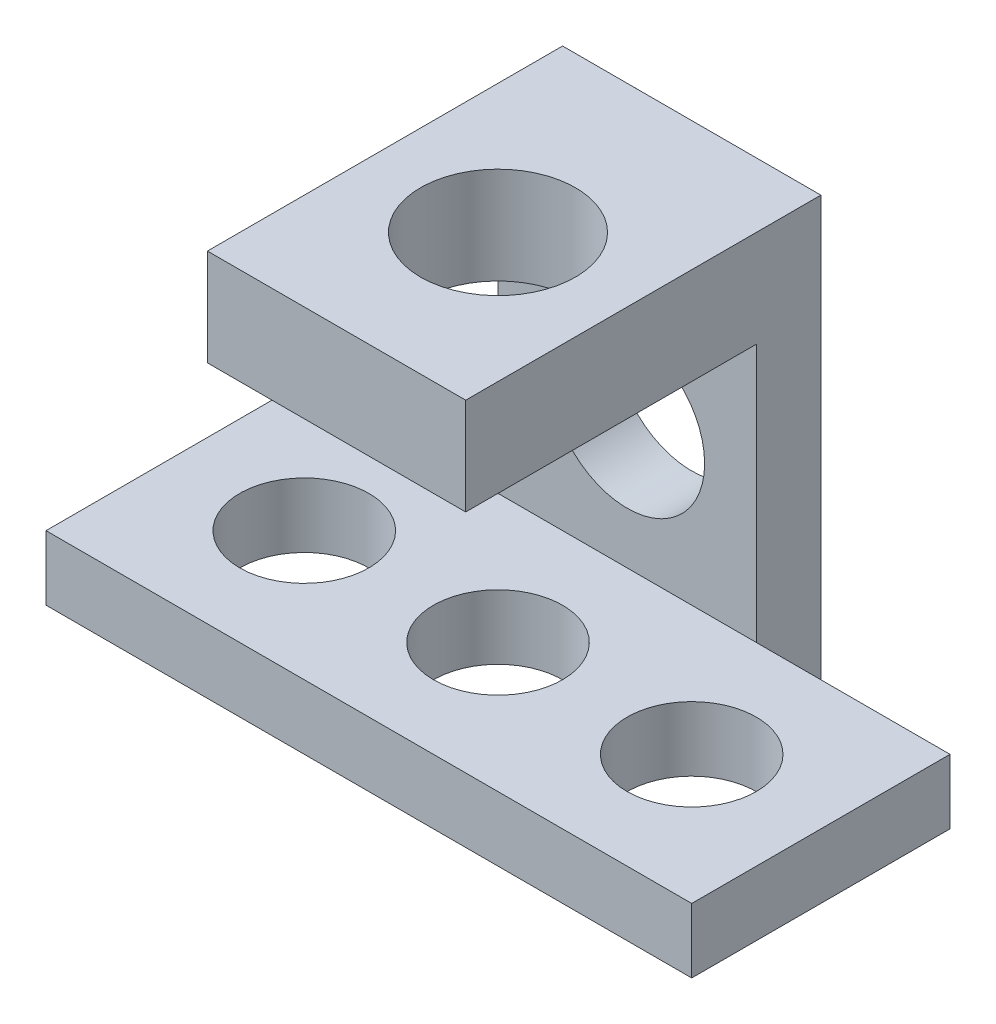
ISO-10303-21;
HEADER;
FILE_DESCRIPTION(('STEP AP214'),'2;1');
FILE_NAME('part.step','',(''),(''),'','','');
FILE_SCHEMA(('AUTOMOTIVE_DESIGN { 1 0 10303 214 1 1 1 1 }'));
ENDSEC;
DATA;
#1=APPLICATION_CONTEXT('core data for automotive mechanical design processes');
#2=APPLICATION_PROTOCOL_DEFINITION('international standard','automotive_design',2000,#1);
#3=PRODUCT_CONTEXT('',#1,'mechanical');
#4=PRODUCT('Part','Part','',(#3));
#5=PRODUCT_RELATED_PRODUCT_CATEGORY('part','',(#4));
#6=PRODUCT_DEFINITION_FORMATION('','',#4);
#7=PRODUCT_DEFINITION_CONTEXT('part definition',#1,'design');
#8=PRODUCT_DEFINITION('design','',#6,#7);
#9=PRODUCT_DEFINITION_SHAPE('','',#8);
#10=(LENGTH_UNIT() NAMED_UNIT(*) SI_UNIT(.MILLI.,.METRE.));
#11=(NAMED_UNIT(*) PLANE_ANGLE_UNIT() SI_UNIT($,.RADIAN.));
#12=(NAMED_UNIT(*) SI_UNIT($,.STERADIAN.) SOLID_ANGLE_UNIT());
#13=UNCERTAINTY_MEASURE_WITH_UNIT(LENGTH_MEASURE(1.E-05),#10,'distance_accuracy_value','');
#14=(GEOMETRIC_REPRESENTATION_CONTEXT(3) GLOBAL_UNCERTAINTY_ASSIGNED_CONTEXT((#13)) GLOBAL_UNIT_ASSIGNED_CONTEXT((#10,
#11,#12)) REPRESENTATION_CONTEXT('',''));
#15=CARTESIAN_POINT('',(0.,0.,0.));
#16=DIRECTION('',(0.,0.,1.));
#17=DIRECTION('',(1.,0.,0.));
#18=AXIS2_PLACEMENT_3D('',#15,#16,#17);
#19=CARTESIAN_POINT('',(70.,65.,-40.));
#20=DIRECTION('',(0.,0.,-1.));
#21=DIRECTION('',(-1.,0.,0.));
#22=AXIS2_PLACEMENT_3D('',#19,#20,#21);
#23=PLANE('',#22);
#24=CARTESIAN_POINT('',(50.,30.,-40.));
#25=DIRECTION('',(0.,0.,1.));
#26=DIRECTION('',(1.,0.,0.));
#27=AXIS2_PLACEMENT_3D('',#24,#25,#26);
#28=CIRCLE('',#27,12.);
#29=CARTESIAN_POINT('',(62.,30.,-40.));
#30=VERTEX_POINT('',#29);
#31=EDGE_CURVE('E472',#30,#30,#28,.T.);
#32=ORIENTED_EDGE('',*,*,#31,.F.);
#33=EDGE_LOOP('',(#32));
#34=FACE_BOUND('',#33,.T.);
#35=DIRECTION('',(1.,0.,0.));
#36=VECTOR('',#35,1.);
#37=CARTESIAN_POINT('',(30.,50.,-40.));
#38=LINE('',#37,#36);
#39=CARTESIAN_POINT('',(30.,50.,-40.));
#40=VERTEX_POINT('',#39);
#41=CARTESIAN_POINT('',(70.,50.,-40.));
#42=VERTEX_POINT('',#41);
#43=EDGE_CURVE('E444',#40,#42,#38,.T.);
#44=ORIENTED_EDGE('',*,*,#43,.F.);
#45=DIRECTION('',(0.,-1.,0.));
#46=VECTOR('',#45,1.);
#47=CARTESIAN_POINT('',(30.,65.,-40.));
#48=LINE('',#47,#46);
#49=CARTESIAN_POINT('',(30.,10.,-40.));
#50=VERTEX_POINT('',#49);
#51=EDGE_CURVE('E202',#40,#50,#48,.T.);
#52=ORIENTED_EDGE('',*,*,#51,.T.);
#53=DIRECTION('',(1.,0.,0.));
#54=VECTOR('',#53,1.);
#55=CARTESIAN_POINT('',(70.,10.,-40.));
#56=LINE('',#55,#54);
#57=CARTESIAN_POINT('',(70.,10.,-40.));
#58=VERTEX_POINT('',#57);
#59=EDGE_CURVE('E213',#50,#58,#56,.T.);
#60=ORIENTED_EDGE('',*,*,#59,.T.);
#61=DIRECTION('',(0.,-1.,0.));
#62=VECTOR('',#61,1.);
#63=CARTESIAN_POINT('',(70.,65.,-40.));
#64=LINE('',#63,#62);
#65=EDGE_CURVE('E192',#42,#58,#64,.T.);
#66=ORIENTED_EDGE('',*,*,#65,.F.);
#67=EDGE_LOOP('',(#44,#52,#60,#66));
#68=FACE_BOUND('',#67,.T.);
#69=ADVANCED_FACE('F41',(#34,#68),#23,.F.);
#70=CARTESIAN_POINT('',(0.,10.,-40.));
#71=DIRECTION('',(1.,0.,0.));
#72=DIRECTION('',(0.,0.,-1.));
#73=AXIS2_PLACEMENT_3D('',#70,#71,#72);
#74=PLANE('',#73);
#75=DIRECTION('',(0.,0.,1.));
#76=VECTOR('',#75,1.);
#77=CARTESIAN_POINT('',(0.,0.,-40.));
#78=LINE('',#77,#76);
#79=CARTESIAN_POINT('',(0.,0.,-40.));
#80=VERTEX_POINT('',#79);
#81=CARTESIAN_POINT('',(0.,0.,0.));
#82=VERTEX_POINT('',#81);
#83=EDGE_CURVE('E143',#80,#82,#78,.T.);
#84=ORIENTED_EDGE('',*,*,#83,.T.);
#85=DIRECTION('',(0.,-1.,0.));
#86=VECTOR('',#85,1.);
#87=CARTESIAN_POINT('',(0.,10.,0.));
#88=LINE('',#87,#86);
#89=CARTESIAN_POINT('',(0.,10.,0.));
#90=VERTEX_POINT('',#89);
#91=EDGE_CURVE('E11',#90,#82,#88,.T.);
#92=ORIENTED_EDGE('',*,*,#91,.F.);
#93=DIRECTION('',(0.,0.,1.));
#94=VECTOR('',#93,1.);
#95=CARTESIAN_POINT('',(0.,10.,-40.));
#96=LINE('',#95,#94);
#97=CARTESIAN_POINT('',(0.,10.,-40.));
#98=VERTEX_POINT('',#97);
#99=EDGE_CURVE('E166',#98,#90,#96,.T.);
#100=ORIENTED_EDGE('',*,*,#99,.F.);
#101=DIRECTION('',(0.,-1.,0.));
#102=VECTOR('',#101,1.);
#103=CARTESIAN_POINT('',(0.,10.,-40.));
#104=LINE('',#103,#102);
#105=EDGE_CURVE('E139',#98,#80,#104,.T.);
#106=ORIENTED_EDGE('',*,*,#105,.T.);
#107=EDGE_LOOP('',(#84,#92,#100,#106));
#108=FACE_BOUND('',#107,.T.);
#109=ADVANCED_FACE('F43',(#108),#74,.F.);
#110=CARTESIAN_POINT('',(0.,10.,0.));
#111=DIRECTION('',(0.,0.,-1.));
#112=DIRECTION('',(-1.,0.,0.));
#113=AXIS2_PLACEMENT_3D('',#110,#111,#112);
#114=PLANE('',#113);
#115=DIRECTION('',(1.,0.,0.));
#116=VECTOR('',#115,1.);
#117=CARTESIAN_POINT('',(0.,0.,0.));
#118=LINE('',#117,#116);
#119=CARTESIAN_POINT('',(100.,0.,0.));
#120=VERTEX_POINT('',#119);
#121=EDGE_CURVE('E147',#82,#120,#118,.T.);
#122=ORIENTED_EDGE('',*,*,#121,.T.);
#123=DIRECTION('',(0.,-1.,0.));
#124=VECTOR('',#123,1.);
#125=CARTESIAN_POINT('',(100.,10.,0.));
#126=LINE('',#125,#124);
#127=CARTESIAN_POINT('',(100.,10.,0.));
#128=VERTEX_POINT('',#127);
#129=EDGE_CURVE('E51',#128,#120,#126,.T.);
#130=ORIENTED_EDGE('',*,*,#129,.F.);
#131=DIRECTION('',(1.,0.,0.));
#132=VECTOR('',#131,1.);
#133=CARTESIAN_POINT('',(0.,10.,0.));
#134=LINE('',#133,#132);
#135=EDGE_CURVE('E104',#90,#128,#134,.T.);
#136=ORIENTED_EDGE('',*,*,#135,.F.);
#137=ORIENTED_EDGE('',*,*,#91,.T.);
#138=EDGE_LOOP('',(#122,#130,#136,#137));
#139=FACE_BOUND('',#138,.T.);
#140=ADVANCED_FACE('F242',(#139),#114,.F.);
#141=CARTESIAN_POINT('',(100.,10.,0.));
#142=DIRECTION('',(-1.,0.,0.));
#143=DIRECTION('',(0.,0.,1.));
#144=AXIS2_PLACEMENT_3D('',#141,#142,#143);
#145=PLANE('',#144);
#146=DIRECTION('',(0.,0.,-1.));
#147=VECTOR('',#146,1.);
#148=CARTESIAN_POINT('',(100.,0.,0.));
#149=LINE('',#148,#147);
#150=CARTESIAN_POINT('',(100.,0.,-40.));
#151=VERTEX_POINT('',#150);
#152=EDGE_CURVE('E127',#120,#151,#149,.T.);
#153=ORIENTED_EDGE('',*,*,#152,.T.);
#154=DIRECTION('',(0.,-1.,0.));
#155=VECTOR('',#154,1.);
#156=CARTESIAN_POINT('',(100.,10.,-40.));
#157=LINE('',#156,#155);
#158=CARTESIAN_POINT('',(100.,10.,-40.));
#159=VERTEX_POINT('',#158);
#160=EDGE_CURVE('E124',#159,#151,#157,.T.);
#161=ORIENTED_EDGE('',*,*,#160,.F.);
#162=DIRECTION('',(0.,0.,-1.));
#163=VECTOR('',#162,1.);
#164=CARTESIAN_POINT('',(100.,10.,0.));
#165=LINE('',#164,#163);
#166=EDGE_CURVE('E112',#128,#159,#165,.T.);
#167=ORIENTED_EDGE('',*,*,#166,.F.);
#168=ORIENTED_EDGE('',*,*,#129,.T.);
#169=EDGE_LOOP('',(#153,#161,#167,#168));
#170=FACE_BOUND('',#169,.T.);
#171=ADVANCED_FACE('F125',(#170),#145,.F.);
#172=CARTESIAN_POINT('',(100.,10.,-40.));
#173=DIRECTION('',(0.,0.,1.));
#174=DIRECTION('',(1.,0.,0.));
#175=AXIS2_PLACEMENT_3D('',#172,#173,#174);
#176=PLANE('',#175);
#177=DIRECTION('',(-1.,0.,0.));
#178=VECTOR('',#177,1.);
#179=CARTESIAN_POINT('',(100.,0.,-40.));
#180=LINE('',#179,#178);
#181=CARTESIAN_POINT('',(70.,0.,-40.));
#182=VERTEX_POINT('',#181);
#183=EDGE_CURVE('E153',#151,#182,#180,.T.);
#184=ORIENTED_EDGE('',*,*,#183,.T.);
#185=DIRECTION('',(0.,-1.,0.));
#186=VECTOR('',#185,1.);
#187=CARTESIAN_POINT('',(70.,10.,-40.));
#188=LINE('',#187,#186);
#189=EDGE_CURVE('E131',#58,#182,#188,.T.);
#190=ORIENTED_EDGE('',*,*,#189,.F.);
#191=DIRECTION('',(-1.,0.,0.));
#192=VECTOR('',#191,1.);
#193=CARTESIAN_POINT('',(100.,10.,-40.));
#194=LINE('',#193,#192);
#195=EDGE_CURVE('E117',#159,#58,#194,.T.);
#196=ORIENTED_EDGE('',*,*,#195,.F.);
#197=ORIENTED_EDGE('',*,*,#160,.T.);
#198=EDGE_LOOP('',(#184,#190,#196,#197));
#199=FACE_BOUND('',#198,.T.);
#200=ADVANCED_FACE('F134',(#199),#176,.F.);
#201=CARTESIAN_POINT('',(70.,10.,-40.));
#202=DIRECTION('',(-1.,0.,0.));
#203=DIRECTION('',(0.,0.,1.));
#204=AXIS2_PLACEMENT_3D('',#201,#202,#203);
#205=PLANE('',#204);
#206=DIRECTION('',(0.,0.,-1.));
#207=VECTOR('',#206,1.);
#208=CARTESIAN_POINT('',(70.,0.,-40.));
#209=LINE('',#208,#207);
#210=CARTESIAN_POINT('',(70.,0.,-50.));
#211=VERTEX_POINT('',#210);
#212=EDGE_CURVE('E156',#182,#211,#209,.T.);
#213=ORIENTED_EDGE('',*,*,#212,.T.);
#214=DIRECTION('',(0.,-1.,0.));
#215=VECTOR('',#214,1.);
#216=CARTESIAN_POINT('',(70.,10.,-50.));
#217=LINE('',#216,#215);
#218=CARTESIAN_POINT('',(70.,65.,-50.));
#219=VERTEX_POINT('',#218);
#220=EDGE_CURVE('E175',#219,#211,#217,.T.);
#221=ORIENTED_EDGE('',*,*,#220,.F.);
#222=DIRECTION('',(0.,0.,-1.));
#223=VECTOR('',#222,1.);
#224=CARTESIAN_POINT('',(70.,65.,-50.));
#225=LINE('',#224,#223);
#226=CARTESIAN_POINT('',(70.,65.,4.99999999999998));
#227=VERTEX_POINT('',#226);
#228=EDGE_CURVE('E480',#227,#219,#225,.T.);
#229=ORIENTED_EDGE('',*,*,#228,.F.);
#230=DIRECTION('',(0.,1.,0.));
#231=VECTOR('',#230,1.);
#232=CARTESIAN_POINT('',(70.,50.,4.99999999999998));
#233=LINE('',#232,#231);
#234=CARTESIAN_POINT('',(70.,50.,4.99999999999998));
#235=VERTEX_POINT('',#234);
#236=EDGE_CURVE('E455',#235,#227,#233,.T.);
#237=ORIENTED_EDGE('',*,*,#236,.F.);
#238=DIRECTION('',(0.,0.,-1.));
#239=VECTOR('',#238,1.);
#240=CARTESIAN_POINT('',(70.,50.,4.99999999999998));
#241=LINE('',#240,#239);
#242=EDGE_CURVE('E196',#235,#42,#241,.T.);
#243=ORIENTED_EDGE('',*,*,#242,.T.);
#244=ORIENTED_EDGE('',*,*,#65,.T.);
#245=ORIENTED_EDGE('',*,*,#189,.T.);
#246=EDGE_LOOP('',(#213,#221,#229,#237,#243,#244,#245));
#247=FACE_BOUND('',#246,.T.);
#248=ADVANCED_FACE('F188',(#247),#205,.F.);
#249=CARTESIAN_POINT('',(70.,10.,-50.));
#250=DIRECTION('',(0.,0.,1.));
#251=DIRECTION('',(1.,0.,0.));
#252=AXIS2_PLACEMENT_3D('',#249,#250,#251);
#253=PLANE('',#252);
#254=CARTESIAN_POINT('',(50.,30.,-50.));
#255=DIRECTION('',(0.,0.,1.));
#256=DIRECTION('',(1.,0.,0.));
#257=AXIS2_PLACEMENT_3D('',#254,#255,#256);
#258=CIRCLE('',#257,12.);
#259=CARTESIAN_POINT('',(62.,30.,-50.));
#260=VERTEX_POINT('',#259);
#261=EDGE_CURVE('E473',#260,#260,#258,.T.);
#262=ORIENTED_EDGE('',*,*,#261,.T.);
#263=EDGE_LOOP('',(#262));
#264=FACE_BOUND('',#263,.T.);
#265=DIRECTION('',(-1.,0.,0.));
#266=VECTOR('',#265,1.);
#267=CARTESIAN_POINT('',(70.,0.,-50.));
#268=LINE('',#267,#266);
#269=CARTESIAN_POINT('',(30.,0.,-50.));
#270=VERTEX_POINT('',#269);
#271=EDGE_CURVE('E159',#211,#270,#268,.T.);
#272=ORIENTED_EDGE('',*,*,#271,.T.);
#273=DIRECTION('',(0.,-1.,0.));
#274=VECTOR('',#273,1.);
#275=CARTESIAN_POINT('',(30.,10.,-50.));
#276=LINE('',#275,#274);
#277=CARTESIAN_POINT('',(30.,65.,-50.));
#278=VERTEX_POINT('',#277);
#279=EDGE_CURVE('E172',#278,#270,#276,.T.);
#280=ORIENTED_EDGE('',*,*,#279,.F.);
#281=DIRECTION('',(-1.,0.,0.));
#282=VECTOR('',#281,1.);
#283=CARTESIAN_POINT('',(30.,65.,-50.));
#284=LINE('',#283,#282);
#285=EDGE_CURVE('E210',#219,#278,#284,.T.);
#286=ORIENTED_EDGE('',*,*,#285,.F.);
#287=ORIENTED_EDGE('',*,*,#220,.T.);
#288=EDGE_LOOP('',(#272,#280,#286,#287));
#289=FACE_BOUND('',#288,.T.);
#290=ADVANCED_FACE('F282',(#264,#289),#253,.F.);
#291=CARTESIAN_POINT('',(30.,10.,-50.));
#292=DIRECTION('',(1.,0.,0.));
#293=DIRECTION('',(0.,0.,-1.));
#294=AXIS2_PLACEMENT_3D('',#291,#292,#293);
#295=PLANE('',#294);
#296=DIRECTION('',(0.,0.,1.));
#297=VECTOR('',#296,1.);
#298=CARTESIAN_POINT('',(30.,0.,-50.));
#299=LINE('',#298,#297);
#300=CARTESIAN_POINT('',(30.,0.,-40.));
#301=VERTEX_POINT('',#300);
#302=EDGE_CURVE('E90',#270,#301,#299,.T.);
#303=ORIENTED_EDGE('',*,*,#302,.T.);
#304=DIRECTION('',(0.,-1.,0.));
#305=VECTOR('',#304,1.);
#306=CARTESIAN_POINT('',(30.,10.,-40.));
#307=LINE('',#306,#305);
#308=EDGE_CURVE('E169',#50,#301,#307,.T.);
#309=ORIENTED_EDGE('',*,*,#308,.F.);
#310=ORIENTED_EDGE('',*,*,#51,.F.);
#311=DIRECTION('',(0.,0.,-1.));
#312=VECTOR('',#311,1.);
#313=CARTESIAN_POINT('',(30.,50.,4.99999999999998));
#314=LINE('',#313,#312);
#315=CARTESIAN_POINT('',(30.,50.,4.99999999999998));
#316=VERTEX_POINT('',#315);
#317=EDGE_CURVE('E468',#316,#40,#314,.T.);
#318=ORIENTED_EDGE('',*,*,#317,.F.);
#319=DIRECTION('',(0.,-1.,0.));
#320=VECTOR('',#319,1.);
#321=CARTESIAN_POINT('',(30.,65.,4.99999999999998));
#322=LINE('',#321,#320);
#323=CARTESIAN_POINT('',(30.,65.,4.99999999999998));
#324=VERTEX_POINT('',#323);
#325=EDGE_CURVE('E447',#324,#316,#322,.T.);
#326=ORIENTED_EDGE('',*,*,#325,.F.);
#327=DIRECTION('',(0.,0.,1.));
#328=VECTOR('',#327,1.);
#329=CARTESIAN_POINT('',(30.,65.,-40.));
#330=LINE('',#329,#328);
#331=EDGE_CURVE('E203',#278,#324,#330,.T.);
#332=ORIENTED_EDGE('',*,*,#331,.F.);
#333=ORIENTED_EDGE('',*,*,#279,.T.);
#334=EDGE_LOOP('',(#303,#309,#310,#318,#326,#332,#333));
#335=FACE_BOUND('',#334,.T.);
#336=ADVANCED_FACE('F279',(#335),#295,.F.);
#337=CARTESIAN_POINT('',(30.,10.,-40.));
#338=DIRECTION('',(0.,0.,1.));
#339=DIRECTION('',(1.,0.,0.));
#340=AXIS2_PLACEMENT_3D('',#337,#338,#339);
#341=PLANE('',#340);
#342=DIRECTION('',(-1.,0.,0.));
#343=VECTOR('',#342,1.);
#344=CARTESIAN_POINT('',(30.,0.,-40.));
#345=LINE('',#344,#343);
#346=EDGE_CURVE('E96',#301,#80,#345,.T.);
#347=ORIENTED_EDGE('',*,*,#346,.T.);
#348=ORIENTED_EDGE('',*,*,#105,.F.);
#349=DIRECTION('',(-1.,0.,0.));
#350=VECTOR('',#349,1.);
#351=CARTESIAN_POINT('',(30.,10.,-40.));
#352=LINE('',#351,#350);
#353=EDGE_CURVE('E59',#50,#98,#352,.T.);
#354=ORIENTED_EDGE('',*,*,#353,.F.);
#355=ORIENTED_EDGE('',*,*,#308,.T.);
#356=EDGE_LOOP('',(#347,#348,#354,#355));
#357=FACE_BOUND('',#356,.T.);
#358=ADVANCED_FACE('F273',(#357),#341,.F.);
#359=CARTESIAN_POINT('',(0.,10.,0.));
#360=DIRECTION('',(0.,1.,0.));
#361=DIRECTION('',(0.,0.,1.));
#362=AXIS2_PLACEMENT_3D('',#359,#360,#361);
#363=PLANE('',#362);
#364=ORIENTED_EDGE('',*,*,#59,.F.);
#365=ORIENTED_EDGE('',*,*,#353,.T.);
#366=ORIENTED_EDGE('',*,*,#99,.T.);
#367=ORIENTED_EDGE('',*,*,#135,.T.);
#368=ORIENTED_EDGE('',*,*,#166,.T.);
#369=ORIENTED_EDGE('',*,*,#195,.T.);
#370=EDGE_LOOP('',(#364,#365,#366,#367,#368,#369));
#371=FACE_BOUND('',#370,.T.);
#372=CARTESIAN_POINT('',(80.,10.,-20.));
#373=DIRECTION('',(0.,1.,0.));
#374=DIRECTION('',(0.,0.,1.));
#375=AXIS2_PLACEMENT_3D('',#372,#373,#374);
#376=CIRCLE('',#375,9.99999999999999);
#377=CARTESIAN_POINT('',(80.,10.,-10.));
#378=VERTEX_POINT('',#377);
#379=EDGE_CURVE('E218',#378,#378,#376,.T.);
#380=ORIENTED_EDGE('',*,*,#379,.F.);
#381=EDGE_LOOP('',(#380));
#382=FACE_BOUND('',#381,.T.);
#383=CARTESIAN_POINT('',(50.,10.,-19.9999999999998));
#384=DIRECTION('',(0.,1.,0.));
#385=DIRECTION('',(0.,0.,1.));
#386=AXIS2_PLACEMENT_3D('',#383,#384,#385);
#387=CIRCLE('',#386,9.99999999999999);
#388=CARTESIAN_POINT('',(50.,10.,-9.9999999999998));
#389=VERTEX_POINT('',#388);
#390=EDGE_CURVE('E226',#389,#389,#387,.T.);
#391=ORIENTED_EDGE('',*,*,#390,.F.);
#392=EDGE_LOOP('',(#391));
#393=FACE_BOUND('',#392,.T.);
#394=CARTESIAN_POINT('',(20.,10.,-19.9999999999996));
#395=DIRECTION('',(0.,1.,0.));
#396=DIRECTION('',(0.,0.,1.));
#397=AXIS2_PLACEMENT_3D('',#394,#395,#396);
#398=CIRCLE('',#397,9.99999999999999);
#399=CARTESIAN_POINT('',(20.,10.,-9.99999999999959));
#400=VERTEX_POINT('',#399);
#401=EDGE_CURVE('E207',#400,#400,#398,.T.);
#402=ORIENTED_EDGE('',*,*,#401,.F.);
#403=EDGE_LOOP('',(#402));
#404=FACE_BOUND('',#403,.T.);
#405=ADVANCED_FACE('F114',(#371,#382,#393,#404),#363,.T.);
#406=CARTESIAN_POINT('',(0.,0.,0.));
#407=DIRECTION('',(0.,1.,0.));
#408=DIRECTION('',(0.,0.,1.));
#409=AXIS2_PLACEMENT_3D('',#406,#407,#408);
#410=PLANE('',#409);
#411=CARTESIAN_POINT('',(80.,0.,-20.));
#412=DIRECTION('',(0.,1.,0.));
#413=DIRECTION('',(0.,0.,1.));
#414=AXIS2_PLACEMENT_3D('',#411,#412,#413);
#415=CIRCLE('',#414,9.99999999999999);
#416=CARTESIAN_POINT('',(80.,0.,-10.));
#417=VERTEX_POINT('',#416);
#418=EDGE_CURVE('E148',#417,#417,#415,.T.);
#419=ORIENTED_EDGE('',*,*,#418,.T.);
#420=EDGE_LOOP('',(#419));
#421=FACE_BOUND('',#420,.T.);
#422=CARTESIAN_POINT('',(50.,0.,-19.9999999999998));
#423=DIRECTION('',(0.,1.,0.));
#424=DIRECTION('',(0.,0.,1.));
#425=AXIS2_PLACEMENT_3D('',#422,#423,#424);
#426=CIRCLE('',#425,9.99999999999999);
#427=CARTESIAN_POINT('',(50.,0.,-9.9999999999998));
#428=VERTEX_POINT('',#427);
#429=EDGE_CURVE('E222',#428,#428,#426,.T.);
#430=ORIENTED_EDGE('',*,*,#429,.T.);
#431=EDGE_LOOP('',(#430));
#432=FACE_BOUND('',#431,.T.);
#433=CARTESIAN_POINT('',(20.,0.,-19.9999999999996));
#434=DIRECTION('',(0.,1.,0.));
#435=DIRECTION('',(0.,0.,1.));
#436=AXIS2_PLACEMENT_3D('',#433,#434,#435);
#437=CIRCLE('',#436,9.99999999999999);
#438=CARTESIAN_POINT('',(20.,0.,-9.99999999999959));
#439=VERTEX_POINT('',#438);
#440=EDGE_CURVE('E230',#439,#439,#437,.T.);
#441=ORIENTED_EDGE('',*,*,#440,.T.);
#442=EDGE_LOOP('',(#441));
#443=FACE_BOUND('',#442,.T.);
#444=ORIENTED_EDGE('',*,*,#83,.F.);
#445=ORIENTED_EDGE('',*,*,#346,.F.);
#446=ORIENTED_EDGE('',*,*,#302,.F.);
#447=ORIENTED_EDGE('',*,*,#271,.F.);
#448=ORIENTED_EDGE('',*,*,#212,.F.);
#449=ORIENTED_EDGE('',*,*,#183,.F.);
#450=ORIENTED_EDGE('',*,*,#152,.F.);
#451=ORIENTED_EDGE('',*,*,#121,.F.);
#452=EDGE_LOOP('',(#444,#445,#446,#447,#448,#449,#450,#451));
#453=FACE_BOUND('',#452,.T.);
#454=ADVANCED_FACE('F183',(#421,#432,#443,#453),#410,.F.);
#455=CARTESIAN_POINT('',(20.,0.,-19.9999999999996));
#456=DIRECTION('',(0.,1.,0.));
#457=DIRECTION('',(0.,0.,1.));
#458=AXIS2_PLACEMENT_3D('',#455,#456,#457);
#459=CYLINDRICAL_SURFACE('',#458,9.99999999999999);
#460=ORIENTED_EDGE('',*,*,#440,.F.);
#461=EDGE_LOOP('',(#460));
#462=FACE_BOUND('',#461,.T.);
#463=ORIENTED_EDGE('',*,*,#401,.T.);
#464=EDGE_LOOP('',(#463));
#465=FACE_BOUND('',#464,.T.);
#466=ADVANCED_FACE('F266',(#462,#465),#459,.F.);
#467=CARTESIAN_POINT('',(50.,0.,-19.9999999999998));
#468=DIRECTION('',(0.,1.,0.));
#469=DIRECTION('',(0.,0.,1.));
#470=AXIS2_PLACEMENT_3D('',#467,#468,#469);
#471=CYLINDRICAL_SURFACE('',#470,9.99999999999999);
#472=ORIENTED_EDGE('',*,*,#429,.F.);
#473=EDGE_LOOP('',(#472));
#474=FACE_BOUND('',#473,.T.);
#475=ORIENTED_EDGE('',*,*,#390,.T.);
#476=EDGE_LOOP('',(#475));
#477=FACE_BOUND('',#476,.T.);
#478=ADVANCED_FACE('F262',(#474,#477),#471,.F.);
#479=CARTESIAN_POINT('',(80.,0.,-20.));
#480=DIRECTION('',(0.,1.,0.));
#481=DIRECTION('',(0.,0.,1.));
#482=AXIS2_PLACEMENT_3D('',#479,#480,#481);
#483=CYLINDRICAL_SURFACE('',#482,9.99999999999999);
#484=ORIENTED_EDGE('',*,*,#418,.F.);
#485=EDGE_LOOP('',(#484));
#486=FACE_BOUND('',#485,.T.);
#487=ORIENTED_EDGE('',*,*,#379,.T.);
#488=EDGE_LOOP('',(#487));
#489=FACE_BOUND('',#488,.T.);
#490=ADVANCED_FACE('F259',(#486,#489),#483,.F.);
#491=CARTESIAN_POINT('',(0.,65.,0.));
#492=DIRECTION('',(0.,-1.,0.));
#493=DIRECTION('',(0.,0.,-1.));
#494=AXIS2_PLACEMENT_3D('',#491,#492,#493);
#495=PLANE('',#494);
#496=CARTESIAN_POINT('',(50.,65.,-20.));
#497=DIRECTION('',(0.,1.,0.));
#498=DIRECTION('',(0.,0.,1.));
#499=AXIS2_PLACEMENT_3D('',#496,#497,#498);
#500=CIRCLE('',#499,12.);
#501=CARTESIAN_POINT('',(50.,65.,-8.00000000000002));
#502=VERTEX_POINT('',#501);
#503=EDGE_CURVE('E440',#502,#502,#500,.T.);
#504=ORIENTED_EDGE('',*,*,#503,.F.);
#505=EDGE_LOOP('',(#504));
#506=FACE_BOUND('',#505,.T.);
#507=ORIENTED_EDGE('',*,*,#228,.T.);
#508=ORIENTED_EDGE('',*,*,#285,.T.);
#509=ORIENTED_EDGE('',*,*,#331,.T.);
#510=DIRECTION('',(-1.,0.,0.));
#511=VECTOR('',#510,1.);
#512=CARTESIAN_POINT('',(70.,65.,4.99999999999998));
#513=LINE('',#512,#511);
#514=EDGE_CURVE('E459',#227,#324,#513,.T.);
#515=ORIENTED_EDGE('',*,*,#514,.F.);
#516=EDGE_LOOP('',(#507,#508,#509,#515));
#517=FACE_BOUND('',#516,.T.);
#518=ADVANCED_FACE('F257',(#506,#517),#495,.F.);
#519=CARTESIAN_POINT('',(50.,30.,-50.));
#520=DIRECTION('',(0.,0.,1.));
#521=DIRECTION('',(1.,0.,0.));
#522=AXIS2_PLACEMENT_3D('',#519,#520,#521);
#523=CYLINDRICAL_SURFACE('',#522,12.);
#524=ORIENTED_EDGE('',*,*,#261,.F.);
#525=EDGE_LOOP('',(#524));
#526=FACE_BOUND('',#525,.T.);
#527=ORIENTED_EDGE('',*,*,#31,.T.);
#528=EDGE_LOOP('',(#527));
#529=FACE_BOUND('',#528,.T.);
#530=ADVANCED_FACE('F337',(#526,#529),#523,.F.);
#531=CARTESIAN_POINT('',(30.,50.,4.99999999999998));
#532=DIRECTION('',(0.,1.,0.));
#533=DIRECTION('',(0.,0.,1.));
#534=AXIS2_PLACEMENT_3D('',#531,#532,#533);
#535=PLANE('',#534);
#536=CARTESIAN_POINT('',(50.,50.,-20.));
#537=DIRECTION('',(0.,1.,0.));
#538=DIRECTION('',(0.,0.,1.));
#539=AXIS2_PLACEMENT_3D('',#536,#537,#538);
#540=CIRCLE('',#539,12.);
#541=CARTESIAN_POINT('',(50.,50.,-8.00000000000002));
#542=VERTEX_POINT('',#541);
#543=EDGE_CURVE('E437',#542,#542,#540,.T.);
#544=ORIENTED_EDGE('',*,*,#543,.T.);
#545=EDGE_LOOP('',(#544));
#546=FACE_BOUND('',#545,.T.);
#547=ORIENTED_EDGE('',*,*,#43,.T.);
#548=ORIENTED_EDGE('',*,*,#242,.F.);
#549=DIRECTION('',(1.,0.,0.));
#550=VECTOR('',#549,1.);
#551=CARTESIAN_POINT('',(30.,50.,4.99999999999998));
#552=LINE('',#551,#550);
#553=EDGE_CURVE('E451',#316,#235,#552,.T.);
#554=ORIENTED_EDGE('',*,*,#553,.F.);
#555=ORIENTED_EDGE('',*,*,#317,.T.);
#556=EDGE_LOOP('',(#547,#548,#554,#555));
#557=FACE_BOUND('',#556,.T.);
#558=ADVANCED_FACE('F344',(#546,#557),#535,.F.);
#559=CARTESIAN_POINT('',(0.,0.,4.99999999999998));
#560=DIRECTION('',(0.,0.,1.));
#561=DIRECTION('',(1.,0.,0.));
#562=AXIS2_PLACEMENT_3D('',#559,#560,#561);
#563=PLANE('',#562);
#564=ORIENTED_EDGE('',*,*,#325,.T.);
#565=ORIENTED_EDGE('',*,*,#553,.T.);
#566=ORIENTED_EDGE('',*,*,#236,.T.);
#567=ORIENTED_EDGE('',*,*,#514,.T.);
#568=EDGE_LOOP('',(#564,#565,#566,#567));
#569=FACE_BOUND('',#568,.T.);
#570=ADVANCED_FACE('F350',(#569),#563,.T.);
#571=CARTESIAN_POINT('',(50.,50.,-20.));
#572=DIRECTION('',(0.,1.,0.));
#573=DIRECTION('',(0.,0.,1.));
#574=AXIS2_PLACEMENT_3D('',#571,#572,#573);
#575=CYLINDRICAL_SURFACE('',#574,12.);
#576=ORIENTED_EDGE('',*,*,#543,.F.);
#577=EDGE_LOOP('',(#576));
#578=FACE_BOUND('',#577,.T.);
#579=ORIENTED_EDGE('',*,*,#503,.T.);
#580=EDGE_LOOP('',(#579));
#581=FACE_BOUND('',#580,.T.);
#582=ADVANCED_FACE('F358',(#578,#581),#575,.F.);
#583=CLOSED_SHELL('',(#69,#109,#140,#171,#200,#248,#290,#336,#358,#405,#454,#466,#478,#490,#518,
#530,#558,#570,#582));
#584=MANIFOLD_SOLID_BREP('B2',#583);
#585=ADVANCED_BREP_SHAPE_REPRESENTATION('',(#18,#584),#14);
#586=SHAPE_DEFINITION_REPRESENTATION(#9,#585);
ENDSEC;
END-ISO-10303-21;
